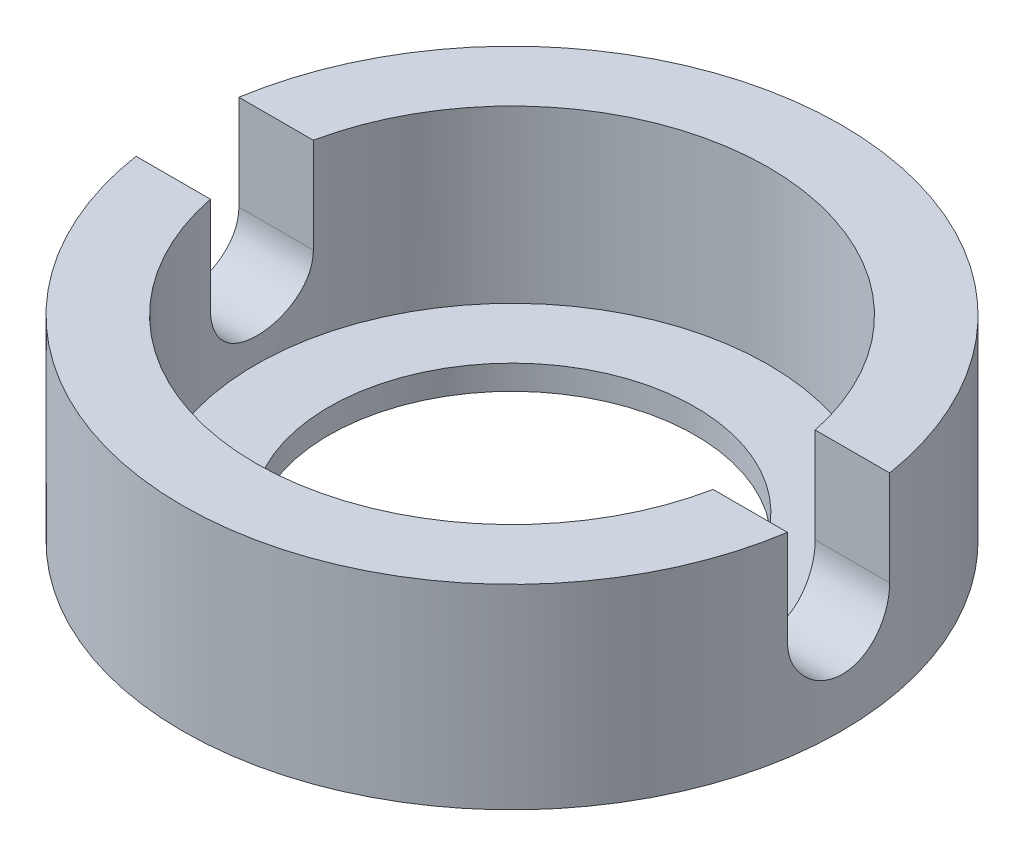
ISO-10303-21;
HEADER;
FILE_DESCRIPTION(('STEP AP214'),'2;1');
FILE_NAME('part.step','',(''),(''),'','','');
FILE_SCHEMA(('AUTOMOTIVE_DESIGN { 1 0 10303 214 1 1 1 1 }'));
ENDSEC;
DATA;
#1=APPLICATION_CONTEXT('core data for automotive mechanical design processes');
#2=APPLICATION_PROTOCOL_DEFINITION('international standard','automotive_design',2000,#1);
#3=PRODUCT_CONTEXT('',#1,'mechanical');
#4=PRODUCT('Part','Part','',(#3));
#5=PRODUCT_RELATED_PRODUCT_CATEGORY('part','',(#4));
#6=PRODUCT_DEFINITION_FORMATION('','',#4);
#7=PRODUCT_DEFINITION_CONTEXT('part definition',#1,'design');
#8=PRODUCT_DEFINITION('design','',#6,#7);
#9=PRODUCT_DEFINITION_SHAPE('','',#8);
#10=(LENGTH_UNIT() NAMED_UNIT(*) SI_UNIT(.MILLI.,.METRE.));
#11=(NAMED_UNIT(*) PLANE_ANGLE_UNIT() SI_UNIT($,.RADIAN.));
#12=(NAMED_UNIT(*) SI_UNIT($,.STERADIAN.) SOLID_ANGLE_UNIT());
#13=UNCERTAINTY_MEASURE_WITH_UNIT(LENGTH_MEASURE(1.E-05),#10,'distance_accuracy_value','');
#14=(GEOMETRIC_REPRESENTATION_CONTEXT(3) GLOBAL_UNCERTAINTY_ASSIGNED_CONTEXT((#13)) GLOBAL_UNIT_ASSIGNED_CONTEXT((#10,
#11,#12)) REPRESENTATION_CONTEXT('',''));
#15=CARTESIAN_POINT('',(0.,0.,0.));
#16=DIRECTION('',(0.,0.,1.));
#17=DIRECTION('',(1.,0.,0.));
#18=AXIS2_PLACEMENT_3D('',#15,#16,#17);
#19=CARTESIAN_POINT('',(0.,8.,0.));
#20=DIRECTION('',(0.,1.,0.));
#21=DIRECTION('',(0.,0.,1.));
#22=AXIS2_PLACEMENT_3D('',#19,#20,#21);
#23=PLANE('',#22);
#24=DIRECTION('',(1.,0.,0.));
#25=VECTOR('',#24,1.);
#26=CARTESIAN_POINT('',(-13.5,8.,-2.14085402285714));
#27=LINE('',#26,#25);
#28=CARTESIAN_POINT('',(10.2794330608656,8.,-2.14085402285714));
#29=VERTEX_POINT('',#28);
#30=CARTESIAN_POINT('',(13.3291689183091,8.,-2.14085402285714));
#31=VERTEX_POINT('',#30);
#32=EDGE_CURVE('E209',#29,#31,#27,.T.);
#33=ORIENTED_EDGE('',*,*,#32,.T.);
#34=CARTESIAN_POINT('',(0.,8.,0.));
#35=DIRECTION('',(0.,1.,0.));
#36=DIRECTION('',(0.,0.,1.));
#37=AXIS2_PLACEMENT_3D('',#34,#35,#36);
#38=CIRCLE('',#37,13.5);
#39=CARTESIAN_POINT('',(-13.3291689183091,8.,-2.14085402285714));
#40=VERTEX_POINT('',#39);
#41=EDGE_CURVE('E125',#31,#40,#38,.T.);
#42=ORIENTED_EDGE('',*,*,#41,.T.);
#43=CARTESIAN_POINT('',(-10.2794330608656,8.,-2.14085402285714));
#44=VERTEX_POINT('',#43);
#45=EDGE_CURVE('E208',#40,#44,#27,.T.);
#46=ORIENTED_EDGE('',*,*,#45,.T.);
#47=CARTESIAN_POINT('',(0.,8.,0.));
#48=DIRECTION('',(0.,1.,0.));
#49=DIRECTION('',(0.,0.,1.));
#50=AXIS2_PLACEMENT_3D('',#47,#48,#49);
#51=CIRCLE('',#50,10.5);
#52=EDGE_CURVE('E189',#29,#44,#51,.T.);
#53=ORIENTED_EDGE('',*,*,#52,.F.);
#54=EDGE_LOOP('',(#33,#42,#46,#53));
#55=FACE_BOUND('',#54,.T.);
#56=ADVANCED_FACE('F37',(#55),#23,.T.);
#57=CARTESIAN_POINT('',(0.,8.,0.));
#58=DIRECTION('',(0.,-1.,0.));
#59=DIRECTION('',(0.,0.,-1.));
#60=AXIS2_PLACEMENT_3D('',#57,#58,#59);
#61=CYLINDRICAL_SURFACE('',#60,13.5);
#62=ORIENTED_EDGE('',*,*,#41,.F.);
#63=DIRECTION('',(0.,-1.,0.));
#64=VECTOR('',#63,1.);
#65=CARTESIAN_POINT('',(13.3291689183091,8.,-2.14085402285714));
#66=LINE('',#65,#64);
#67=CARTESIAN_POINT('',(13.3291689183091,4.1,-2.14085402285715));
#68=VERTEX_POINT('',#67);
#69=EDGE_CURVE('E180',#31,#68,#66,.T.);
#70=ORIENTED_EDGE('',*,*,#69,.T.);
#71=CARTESIAN_POINT('',(13.3291689183091,4.1,-2.14085402285715));
#72=CARTESIAN_POINT('',(13.3291666447354,4.0413161164784,-2.14085407238651));
#73=CARTESIAN_POINT('',(13.3295644995685,3.9826607121262,-2.13839264517743));
#74=CARTESIAN_POINT('',(13.3311365296593,3.86577692806892,-2.1285759084212));
#75=CARTESIAN_POINT('',(13.332310631424,3.80754850846563,-2.12122106217015));
#76=CARTESIAN_POINT('',(13.3369549969305,3.63428557553989,-2.09190050732567));
#77=CARTESIAN_POINT('',(13.3415475192242,3.52042321402695,-2.06267849687624));
#78=CARTESIAN_POINT('',(13.3532128808782,3.29930130999009,-1.98574924381743));
#79=CARTESIAN_POINT('',(13.3602863268776,3.19204338994122,-1.93803747976744));
#80=CARTESIAN_POINT('',(13.3761252744474,2.98703847270402,-1.82551067120954));
#81=CARTESIAN_POINT('',(13.3848907622839,2.88929139832758,-1.76069576552313));
#82=CARTESIAN_POINT('',(13.4032284632168,2.70524685304988,-1.615199440081));
#83=CARTESIAN_POINT('',(13.4128064766904,2.61904543509215,-1.53439729057134));
#84=CARTESIAN_POINT('',(13.4316626029378,2.46135513656441,-1.35947206176285));
#85=CARTESIAN_POINT('',(13.4409406691318,2.38986853194998,-1.26534692557762));
#86=CARTESIAN_POINT('',(13.4582364186023,2.26327183313013,-1.06580560878101));
#87=CARTESIAN_POINT('',(13.4662467837811,2.20825529878887,-0.96032938282561));
#88=CARTESIAN_POINT('',(13.480066477733,2.11675958613247,-0.741493645572168));
#89=CARTESIAN_POINT('',(13.485876055882,2.0802783073871,-0.628135029168872));
#90=CARTESIAN_POINT('',(13.4946290438827,2.02717066550553,-0.397703901817571));
#91=CARTESIAN_POINT('',(13.4975949415391,2.01038828239126,-0.280668218071861));
#92=CARTESIAN_POINT('',(13.5004360537543,1.99667487448008,-0.0454029054317797));
#93=CARTESIAN_POINT('',(13.500311384789,1.99974310155889,0.0728266782995496));
#94=CARTESIAN_POINT('',(13.4970309110249,2.02552118359933,0.306000386871487));
#95=CARTESIAN_POINT('',(13.4939023183522,2.04805452312936,0.420964474333575));
#96=CARTESIAN_POINT('',(13.48502891989,2.11185042673706,0.645463790448504));
#97=CARTESIAN_POINT('',(13.4792840651514,2.15311334123666,0.754998917485399));
#98=CARTESIAN_POINT('',(13.4658115723716,2.25334990507271,0.965995365692651));
#99=CARTESIAN_POINT('',(13.4580767841202,2.31238755546053,1.06742580579377));
#100=CARTESIAN_POINT('',(13.4415093406198,2.44644918837918,1.25900199808933));
#101=CARTESIAN_POINT('',(13.4326766515168,2.52147366391659,1.34914740213626));
#102=CARTESIAN_POINT('',(13.4148115405068,2.68629929073418,1.51657743273771));
#103=CARTESIAN_POINT('',(13.4057779980137,2.77624498205364,1.59371969637863));
#104=CARTESIAN_POINT('',(13.3886336997346,2.96790478500224,1.73186322721121));
#105=CARTESIAN_POINT('',(13.3805232112246,3.0696222881237,1.79285982606983));
#106=CARTESIAN_POINT('',(13.3661547009505,3.28213822031623,1.89702102709096));
#107=CARTESIAN_POINT('',(13.3598999270953,3.39295214252401,1.94015441631568));
#108=CARTESIAN_POINT('',(13.3500085664048,3.62029112988423,2.00709629877518));
#109=CARTESIAN_POINT('',(13.3463680747604,3.73680739851517,2.03093362028725));
#110=CARTESIAN_POINT('',(13.3435070459469,3.89516364928014,2.04959287589203));
#111=CARTESIAN_POINT('',(13.3429526227291,3.93608231244235,2.05319737271173));
#112=CARTESIAN_POINT('',(13.3422131392824,4.01799474061692,2.05799810733157));
#113=CARTESIAN_POINT('',(13.3420274571562,4.05898826227041,2.05919839995311));
#114=CARTESIAN_POINT('',(13.3420273048669,4.1,2.05920066923727));
#115=B_SPLINE_CURVE_WITH_KNOTS('',3,(#71,#72,#73,#74,#75,#76,#77,#78,#79,#80,#81,#82,#83,#84,
#85,#86,#87,#88,#89,#90,#91,#92,#93,#94,#95,#96,#97,#98,#99,#100,#101,#102,#103,#104,#105,#106,
#107,#108,#109,#110,#111,#112,#113,#114),.UNSPECIFIED.,.F.,.F.,(4,2,2,2,2,2,2,2,2,2,2,2,2,2,2,2,
2,2,2,2,2,4),(0.,0.175942344481789,0.351868033572896,0.702978537167625,1.05417495472842,
1.40536852181231,1.75932301890869,2.11333222144867,2.46931582860245,2.82525908640222,
3.17836374735741,3.53145510067965,3.88137773385083,4.23130691418744,4.5825114586147,
4.93372683516233,5.28856768453747,5.64351102026306,5.99907196900305,6.35410072505367,
6.47728952574954,6.60027038628873),.UNSPECIFIED.);
#116=CARTESIAN_POINT('',(13.3420273048669,4.1,2.05920066923727));
#117=VERTEX_POINT('',#116);
#118=EDGE_CURVE('E171',#68,#117,#115,.T.);
#119=ORIENTED_EDGE('',*,*,#118,.T.);
#120=DIRECTION('',(0.,-1.,0.));
#121=VECTOR('',#120,1.);
#122=CARTESIAN_POINT('',(13.3420273048669,8.,2.05920066923727));
#123=LINE('',#122,#121);
#124=CARTESIAN_POINT('',(13.3420273048669,8.,2.05920066923727));
#125=VERTEX_POINT('',#124);
#126=EDGE_CURVE('E110',#117,#125,#123,.F.);
#127=ORIENTED_EDGE('',*,*,#126,.T.);
#128=CARTESIAN_POINT('',(-13.3420273048669,8.,2.05920066923727));
#129=VERTEX_POINT('',#128);
#130=EDGE_CURVE('E117',#129,#125,#38,.T.);
#131=ORIENTED_EDGE('',*,*,#130,.F.);
#132=DIRECTION('',(0.,-1.,0.));
#133=VECTOR('',#132,1.);
#134=CARTESIAN_POINT('',(-13.3420273048669,8.,2.05920066923727));
#135=LINE('',#134,#133);
#136=CARTESIAN_POINT('',(-13.3420273048669,4.1,2.05920066923727));
#137=VERTEX_POINT('',#136);
#138=EDGE_CURVE('E103',#129,#137,#135,.T.);
#139=ORIENTED_EDGE('',*,*,#138,.T.);
#140=CARTESIAN_POINT('',(-13.3420273048669,4.1,2.05920066923727));
#141=CARTESIAN_POINT('',(-13.3420250380575,4.04128147631315,2.05920068725546));
#142=CARTESIAN_POINT('',(-13.3424078899976,3.98259142667355,2.05673638650511));
#143=CARTESIAN_POINT('',(-13.3439201253294,3.8656381488829,2.04690797742173));
#144=CARTESIAN_POINT('',(-13.345049440144,3.80737488202074,2.03954431918867));
#145=CARTESIAN_POINT('',(-13.349515459476,3.63400348049986,2.01018745713353));
#146=CARTESIAN_POINT('',(-13.3539304317712,3.52006750257915,1.98092808729556));
#147=CARTESIAN_POINT('',(-13.3651292914457,3.29879997094988,1.9038946238669));
#148=CARTESIAN_POINT('',(-13.3719137903796,3.19147013064912,1.85611575019914));
#149=CARTESIAN_POINT('',(-13.3870718904365,2.986333575057,1.7434238501291));
#150=CARTESIAN_POINT('',(-13.395445460994,2.88852667664937,1.67851115328153));
#151=CARTESIAN_POINT('',(-13.4128982582088,2.70443431158994,1.5328292343099));
#152=CARTESIAN_POINT('',(-13.4219822000795,2.61823838893025,1.45194745928493));
#153=CARTESIAN_POINT('',(-13.4397681963649,2.46057679043533,1.27685550807547));
#154=CARTESIAN_POINT('',(-13.4484701928585,2.38911334270942,1.1826433194546));
#155=CARTESIAN_POINT('',(-13.4645365799438,2.26263923766982,0.983012822255255));
#156=CARTESIAN_POINT('',(-13.4718944208962,2.20770833955408,0.877543412647226));
#157=CARTESIAN_POINT('',(-13.4843629014716,2.11637702210465,0.658747958825261));
#158=CARTESIAN_POINT('',(-13.4894737998591,2.07997446891664,0.545422821040915));
#159=CARTESIAN_POINT('',(-13.4968096469125,2.02701239491299,0.315104173398595));
#160=CARTESIAN_POINT('',(-13.4990576540486,2.01029441299807,0.198147847187576));
#161=CARTESIAN_POINT('',(-13.5004610268427,1.99667884152571,-0.0369306006978941));
#162=CARTESIAN_POINT('',(-13.4996164968095,1.99978058346772,-0.15505268291832));
#163=CARTESIAN_POINT('',(-13.4949202765294,2.02559322095453,-0.388072741054773));
#164=CARTESIAN_POINT('',(-13.4910936157241,2.04814106984766,-0.5029893445685));
#165=CARTESIAN_POINT('',(-13.4808582201626,2.11194483335533,-0.727382210851564));
#166=CARTESIAN_POINT('',(-13.474449424277,2.15320119087884,-0.836858344754053));
#167=CARTESIAN_POINT('',(-13.459691873806,2.25344395379055,-1.04782541304566));
#168=CARTESIAN_POINT('',(-13.4513345573828,2.31250895668819,-1.14927837913141));
#169=CARTESIAN_POINT('',(-13.4335878855616,2.44663238324329,-1.34089134315004));
#170=CARTESIAN_POINT('',(-13.4241984958551,2.52169133865341,-1.43105096545362));
#171=CARTESIAN_POINT('',(-13.4052940977989,2.68661759587175,-1.59852462547168));
#172=CARTESIAN_POINT('',(-13.3957788110532,2.77663310199776,-1.67569273858411));
#173=CARTESIAN_POINT('',(-13.3777705554045,2.96845204012211,-1.81387089200554));
#174=CARTESIAN_POINT('',(-13.3692778805663,3.07025884642113,-1.87487629055116));
#175=CARTESIAN_POINT('',(-13.3542628952236,3.28290934600207,-1.97900077483558));
#176=CARTESIAN_POINT('',(-13.3477428877928,3.39376341171704,-2.02209897579874));
#177=CARTESIAN_POINT('',(-13.3374437940134,3.62118630177348,-2.08896070452407));
#178=CARTESIAN_POINT('',(-13.3336605868971,3.73774625108898,-2.11275330709532));
#179=CARTESIAN_POINT('',(-13.3306966479362,3.89598198987697,-2.13132301877717));
#180=CARTESIAN_POINT('',(-13.3301242141642,3.93673759011745,-2.13489869627123));
#181=CARTESIAN_POINT('',(-13.3293607571607,4.01832290490787,-2.13966105704106));
#182=CARTESIAN_POINT('',(-13.3291690935136,4.05915237921512,-2.14085175163675));
#183=CARTESIAN_POINT('',(-13.3291689183091,4.1,-2.14085402285715));
#184=B_SPLINE_CURVE_WITH_KNOTS('',3,(#140,#141,#142,#143,#144,#145,#146,#147,#148,#149,#150,
#151,#152,#153,#154,#155,#156,#157,#158,#159,#160,#161,#162,#163,#164,#165,#166,#167,#168,#169,
#170,#171,#172,#173,#174,#175,#176,#177,#178,#179,#180,#181,#182,#183),.UNSPECIFIED.,.F.,.F.,(4,
2,2,2,2,2,2,2,2,2,2,2,2,2,2,2,2,2,2,2,2,4),(0.,0.176046273083847,0.352076375172935,
0.703407342414107,1.05482905229263,1.40624400336172,1.76023039985652,2.11427029331727,
2.46999179463071,2.82567231928293,3.17846959802627,3.53125497731364,3.88111085632614,
4.23097501832883,4.58240646953303,4.93384960664002,5.28900925344732,5.64427078811474,
5.99994550140252,6.3550835584917,6.47777892470032,6.60026775482408),.UNSPECIFIED.);
#185=CARTESIAN_POINT('',(-13.3291689183091,4.1,-2.14085402285715));
#186=VERTEX_POINT('',#185);
#187=EDGE_CURVE('E109',#137,#186,#184,.T.);
#188=ORIENTED_EDGE('',*,*,#187,.T.);
#189=DIRECTION('',(0.,-1.,0.));
#190=VECTOR('',#189,1.);
#191=CARTESIAN_POINT('',(-13.3291689183091,8.,-2.14085402285714));
#192=LINE('',#191,#190);
#193=EDGE_CURVE('E177',#186,#40,#192,.F.);
#194=ORIENTED_EDGE('',*,*,#193,.T.);
#195=EDGE_LOOP('',(#62,#70,#119,#127,#131,#139,#188,#194));
#196=FACE_BOUND('',#195,.T.);
#197=CARTESIAN_POINT('',(0.,0.,0.));
#198=DIRECTION('',(0.,1.,0.));
#199=DIRECTION('',(0.,0.,1.));
#200=AXIS2_PLACEMENT_3D('',#197,#198,#199);
#201=CIRCLE('',#200,13.5);
#202=CARTESIAN_POINT('',(0.,0.,13.5));
#203=VERTEX_POINT('',#202);
#204=EDGE_CURVE('E126',#203,#203,#201,.T.);
#205=ORIENTED_EDGE('',*,*,#204,.T.);
#206=EDGE_LOOP('',(#205));
#207=FACE_BOUND('',#206,.T.);
#208=ADVANCED_FACE('F39',(#196,#207),#61,.T.);
#209=DIRECTION('',(1.,0.,0.));
#210=VECTOR('',#209,1.);
#211=CARTESIAN_POINT('',(-13.5,8.,2.05920066923727));
#212=LINE('',#211,#210);
#213=CARTESIAN_POINT('',(-10.2961008446796,8.,2.05920066923727));
#214=VERTEX_POINT('',#213);
#215=EDGE_CURVE('E61',#129,#214,#212,.T.);
#216=ORIENTED_EDGE('',*,*,#215,.F.);
#217=ORIENTED_EDGE('',*,*,#130,.T.);
#218=CARTESIAN_POINT('',(10.2961008446796,8.,2.05920066923727));
#219=VERTEX_POINT('',#218);
#220=EDGE_CURVE('E120',#219,#125,#212,.T.);
#221=ORIENTED_EDGE('',*,*,#220,.F.);
#222=EDGE_CURVE('E119',#214,#219,#51,.T.);
#223=ORIENTED_EDGE('',*,*,#222,.F.);
#224=EDGE_LOOP('',(#216,#217,#221,#223));
#225=FACE_BOUND('',#224,.T.);
#226=ADVANCED_FACE('F115',(#225),#23,.T.);
#227=CARTESIAN_POINT('',(0.,0.,0.));
#228=DIRECTION('',(0.,1.,0.));
#229=DIRECTION('',(0.,0.,1.));
#230=AXIS2_PLACEMENT_3D('',#227,#228,#229);
#231=PLANE('',#230);
#232=CARTESIAN_POINT('',(0.,0.,0.));
#233=DIRECTION('',(0.,1.,0.));
#234=DIRECTION('',(0.,0.,1.));
#235=AXIS2_PLACEMENT_3D('',#232,#233,#234);
#236=CIRCLE('',#235,7.5);
#237=CARTESIAN_POINT('',(0.,0.,7.5));
#238=VERTEX_POINT('',#237);
#239=EDGE_CURVE('E184',#238,#238,#236,.T.);
#240=ORIENTED_EDGE('',*,*,#239,.T.);
#241=EDGE_LOOP('',(#240));
#242=FACE_BOUND('',#241,.T.);
#243=ORIENTED_EDGE('',*,*,#204,.F.);
#244=EDGE_LOOP('',(#243));
#245=FACE_BOUND('',#244,.T.);
#246=ADVANCED_FACE('F223',(#242,#245),#231,.F.);
#247=CARTESIAN_POINT('',(0.,1.,0.));
#248=DIRECTION('',(0.,1.,0.));
#249=DIRECTION('',(0.,0.,1.));
#250=AXIS2_PLACEMENT_3D('',#247,#248,#249);
#251=CYLINDRICAL_SURFACE('',#250,10.5);
#252=CARTESIAN_POINT('',(0.,1.,0.));
#253=DIRECTION('',(0.,1.,0.));
#254=DIRECTION('',(0.,0.,1.));
#255=AXIS2_PLACEMENT_3D('',#252,#253,#254);
#256=CIRCLE('',#255,10.5);
#257=CARTESIAN_POINT('',(0.,1.,10.5));
#258=VERTEX_POINT('',#257);
#259=EDGE_CURVE('E131',#258,#258,#256,.T.);
#260=ORIENTED_EDGE('',*,*,#259,.F.);
#261=EDGE_LOOP('',(#260));
#262=FACE_BOUND('',#261,.T.);
#263=CARTESIAN_POINT('',(10.2961008446796,4.1,2.05920066923727));
#264=CARTESIAN_POINT('',(10.2960978502634,4.0415203313302,2.05920095545284));
#265=CARTESIAN_POINT('',(10.2965900148061,3.9830692557303,2.05675638837365));
#266=CARTESIAN_POINT('',(10.2985335354658,3.86659681248869,2.04700846317528));
#267=CARTESIAN_POINT('',(10.2999847751837,3.80857539356531,2.0397056946754));
#268=CARTESIAN_POINT('',(10.3057214983596,3.6359671917194,2.01060179831211));
#269=CARTESIAN_POINT('',(10.3113902777199,3.52255470866377,1.98160473491023));
#270=CARTESIAN_POINT('',(10.3257585528154,3.30232888093954,1.90530768261104));
#271=CARTESIAN_POINT('',(10.334458417328,3.19551634111653,1.85800546653717));
#272=CARTESIAN_POINT('',(10.3538887650087,2.99131074299452,1.74647658515652));
#273=CARTESIAN_POINT('',(10.3646194403572,2.89391857748628,1.68224831787272));
#274=CARTESIAN_POINT('',(10.3870430531995,2.71003831906547,1.53776785545604));
#275=CARTESIAN_POINT('',(10.3987460729661,2.62369661302993,1.45733096890718));
#276=CARTESIAN_POINT('',(10.4216768429921,2.46563288581598,1.28310505416451));
#277=CARTESIAN_POINT('',(10.432904520767,2.39391308800493,1.1893139990494));
#278=CARTESIAN_POINT('',(10.4536967315664,2.26659684281137,0.990109895525937));
#279=CARTESIAN_POINT('',(10.4632472159713,2.21113420556733,0.884609737120281));
#280=CARTESIAN_POINT('',(10.479458876605,2.11877850310552,0.665571390832812));
#281=CARTESIAN_POINT('',(10.4861204845865,2.081882662882,0.552034407035389));
#282=CARTESIAN_POINT('',(10.4956934752195,2.02817655497769,0.321742146447822));
#283=CARTESIAN_POINT('',(10.4986534372298,2.01110631872392,0.20504954667292));
#284=CARTESIAN_POINT('',(10.5006134439046,1.99671692914618,-0.0295774526646849));
#285=CARTESIAN_POINT('',(10.4996137646798,1.99939639866194,-0.147511765069282));
#286=CARTESIAN_POINT('',(10.4937706698322,2.02423461763458,-0.379567275487358));
#287=CARTESIAN_POINT('',(10.4889800779781,2.0461261144693,-0.493718574609014));
#288=CARTESIAN_POINT('',(10.4761081130621,2.10833534941379,-0.71668513649674));
#289=CARTESIAN_POINT('',(10.4680266196867,2.1486537612076,-0.82550020401026));
#290=CARTESIAN_POINT('',(10.4493434692553,2.2468632433064,-1.03558261674724));
#291=CARTESIAN_POINT('',(10.438724546953,2.3048754886043,-1.13679172024091));
#292=CARTESIAN_POINT('',(10.4161102203811,2.43673406496686,-1.32813562876856));
#293=CARTESIAN_POINT('',(10.4041146990433,2.51058174316742,-1.41826949059399));
#294=CARTESIAN_POINT('',(10.3797957517083,2.6735538800855,-1.58657144015987));
#295=CARTESIAN_POINT('',(10.3674702645982,2.76292355964465,-1.66450193572487));
#296=CARTESIAN_POINT('',(10.3440542074896,2.95362709507465,-1.80432409798464));
#297=CARTESIAN_POINT('',(10.3329639781993,3.05496423600496,-1.86621134585457));
#298=CARTESIAN_POINT('',(10.3132528852237,3.26702930926522,-1.9722426783931));
#299=CARTESIAN_POINT('',(10.3046375832124,3.37777767854571,-2.0163468892074));
#300=CARTESIAN_POINT('',(10.2909299510095,3.60525776577763,-2.08518914945158));
#301=CARTESIAN_POINT('',(10.2858323374422,3.7219802264656,-2.10995624955105));
#302=CARTESIAN_POINT('',(10.281673672051,3.88302983319146,-2.13007125531339));
#303=CARTESIAN_POINT('',(10.2808343415574,3.92635870473771,-2.13411617960897));
#304=CARTESIAN_POINT('',(10.2797145107756,4.01311853399728,-2.1395041741175));
#305=CARTESIAN_POINT('',(10.2794330773962,4.05654919941608,-2.14085175571214));
#306=CARTESIAN_POINT('',(10.2794330608656,4.1,-2.14085402285715));
#307=B_SPLINE_CURVE_WITH_KNOTS('',3,(#263,#264,#265,#266,#267,#268,#269,#270,#271,#272,#273,
#274,#275,#276,#277,#278,#279,#280,#281,#282,#283,#284,#285,#286,#287,#288,#289,#290,#291,#292,
#293,#294,#295,#296,#297,#298,#299,#300,#301,#302,#303,#304,#305,#306),.UNSPECIFIED.,.F.,.F.,(4,
2,2,2,2,2,2,2,2,2,2,2,2,2,2,2,2,2,2,2,2,4),(0.,0.175329402459234,0.350637529813798,
0.700419446039913,1.0502439334018,1.40010154202611,1.75419739797084,2.10834705667076,
2.46533469567421,2.82226896321059,3.17446801845092,3.52664251484649,3.87399431759665,
4.22135882046989,4.57115777474089,4.92098649856809,5.27695081747857,5.63301307645519,
5.98986933137228,6.3461884342468,6.47669735456707,6.60698781203551),.UNSPECIFIED.);
#308=CARTESIAN_POINT('',(10.2961008446796,4.1,2.05920066923727));
#309=VERTEX_POINT('',#308);
#310=CARTESIAN_POINT('',(10.2794330608656,4.1,-2.14085402285715));
#311=VERTEX_POINT('',#310);
#312=EDGE_CURVE('E46',#309,#311,#307,.T.);
#313=ORIENTED_EDGE('',*,*,#312,.T.);
#314=DIRECTION('',(0.,1.,0.));
#315=VECTOR('',#314,1.);
#316=CARTESIAN_POINT('',(10.2794330608656,1.,-2.14085402285715));
#317=LINE('',#316,#315);
#318=EDGE_CURVE('E11',#311,#29,#317,.T.);
#319=ORIENTED_EDGE('',*,*,#318,.T.);
#320=ORIENTED_EDGE('',*,*,#52,.T.);
#321=DIRECTION('',(0.,1.,0.));
#322=VECTOR('',#321,1.);
#323=CARTESIAN_POINT('',(-10.2794330608656,1.,-2.14085402285715));
#324=LINE('',#323,#322);
#325=CARTESIAN_POINT('',(-10.2794330608656,4.1,-2.14085402285715));
#326=VERTEX_POINT('',#325);
#327=EDGE_CURVE('E145',#44,#326,#324,.F.);
#328=ORIENTED_EDGE('',*,*,#327,.T.);
#329=CARTESIAN_POINT('',(-10.2794330608656,4.1,-2.14085402285715));
#330=CARTESIAN_POINT('',(-10.2794300497189,4.04157786349726,-2.1408543610372));
#331=CARTESIAN_POINT('',(-10.2799414385396,3.9831843298389,-2.13841454636568));
#332=CARTESIAN_POINT('',(-10.2819615273794,3.86682732020739,-2.12868592444515));
#333=CARTESIAN_POINT('',(-10.2834701016369,3.80886379093564,-2.12139772865601));
#334=CARTESIAN_POINT('',(-10.2894348779916,3.63643567495575,-2.09235384370334));
#335=CARTESIAN_POINT('',(-10.2953304365719,3.52314540753755,-2.06341849939474));
#336=CARTESIAN_POINT('',(-10.3102933641365,3.30316146396367,-1.98729350958736));
#337=CARTESIAN_POINT('',(-10.3193610468425,3.19646844150148,-1.94010205851808));
#338=CARTESIAN_POINT('',(-10.3396571763303,2.99248195285056,-1.82884554686307));
#339=CARTESIAN_POINT('',(-10.350885866707,2.89518954818478,-1.76477858372173));
#340=CARTESIAN_POINT('',(-10.3744410202303,2.71139098899678,-1.62060557826904));
#341=CARTESIAN_POINT('',(-10.3867798703498,2.62504172255031,-1.54030161306431));
#342=CARTESIAN_POINT('',(-10.4110890114725,2.46693340285641,-1.36635453626766));
#343=CARTESIAN_POINT('',(-10.4230592440497,2.3951766525351,-1.27270932317866));
#344=CARTESIAN_POINT('',(-10.4454474154041,2.26765779544746,-1.07365603312942));
#345=CARTESIAN_POINT('',(-10.4558496962335,2.21205246361814,-0.968145610802471));
#346=CARTESIAN_POINT('',(-10.4738245936481,2.11942245398688,-0.749042244011542));
#347=CARTESIAN_POINT('',(-10.4813976241342,2.08239505808229,-0.635450484691046));
#348=CARTESIAN_POINT('',(-10.492813289697,2.0284456692933,-0.40497201563142));
#349=CARTESIAN_POINT('',(-10.4967032836667,2.01126778586857,-0.288147591385897));
#350=CARTESIAN_POINT('',(-10.5005221274011,1.99671443016903,-0.0532100477935262));
#351=CARTESIAN_POINT('',(-10.5004512805206,1.99933744135991,0.0649029721689525));
#352=CARTESIAN_POINT('',(-10.49642643658,2.02411732946966,0.297214242084916));
#353=CARTESIAN_POINT('',(-10.492529918631,2.04598456611605,0.411444558400804));
#354=CARTESIAN_POINT('',(-10.4814018855771,2.10818013129637,0.63458826818168));
#355=CARTESIAN_POINT('',(-10.4741702743367,2.14850899199459,0.743501508279493));
#356=CARTESIAN_POINT('',(-10.4571394209589,2.24670931073482,0.953635764834757));
#357=CARTESIAN_POINT('',(-10.4473259464882,2.30467829510413,1.05481000108632));
#358=CARTESIAN_POINT('',(-10.4262416501084,2.4364399920587,1.24609760224937));
#359=CARTESIAN_POINT('',(-10.4149707106779,2.51023398099526,1.336210074062));
#360=CARTESIAN_POINT('',(-10.3920163436133,2.67304484648645,1.50443989415841));
#361=CARTESIAN_POINT('',(-10.3803291586359,2.7623002371639,1.58232603617969));
#362=CARTESIAN_POINT('',(-10.3580616294068,2.95274267051778,1.72208730546259));
#363=CARTESIAN_POINT('',(-10.3474815938486,3.05393302424057,1.78395797436574));
#364=CARTESIAN_POINT('',(-10.3286328274957,3.26577163002442,1.89004427644451));
#365=CARTESIAN_POINT('',(-10.3203714721901,3.37644863293332,1.93420375899864));
#366=CARTESIAN_POINT('',(-10.3072084529946,3.60377858539652,2.00317434894508));
#367=CARTESIAN_POINT('',(-10.3023018198213,3.72042241970293,2.02801408184198));
#368=CARTESIAN_POINT('',(-10.2982794824195,3.8816660906779,2.04828157481459));
#369=CARTESIAN_POINT('',(-10.2974634184277,3.9252665111428,2.05237765981974));
#370=CARTESIAN_POINT('',(-10.2963745415926,4.0125714048967,2.05783378411792));
#371=CARTESIAN_POINT('',(-10.2961008175716,4.0562755799394,2.05919841253161));
#372=CARTESIAN_POINT('',(-10.2961008446796,4.1,2.05920066923727));
#373=B_SPLINE_CURVE_WITH_KNOTS('',3,(#329,#330,#331,#332,#333,#334,#335,#336,#337,#338,#339,
#340,#341,#342,#343,#344,#345,#346,#347,#348,#349,#350,#351,#352,#353,#354,#355,#356,#357,#358,
#359,#360,#361,#362,#363,#364,#365,#366,#367,#368,#369,#370,#371,#372),.UNSPECIFIED.,.F.,.F.,(4,
2,2,2,2,2,2,2,2,2,2,2,2,2,2,2,2,2,2,2,2,4),(0.,0.175156788890952,0.350291491842902,
0.699707626857063,1.0491583287606,1.39864844482627,1.75268782151301,2.10678302783719,
2.46420846162404,2.82158158591179,3.17429433532048,3.52698007102228,3.87444669597824,
4.22192333744052,4.57135708177363,4.92081901997286,5.27625072708452,5.63178127248278,
5.98843022881539,6.34454973684585,6.47588132597065,6.60699207903848),.UNSPECIFIED.);
#374=CARTESIAN_POINT('',(-10.2961008446796,4.1,2.05920066923727));
#375=VERTEX_POINT('',#374);
#376=EDGE_CURVE('E137',#326,#375,#373,.T.);
#377=ORIENTED_EDGE('',*,*,#376,.T.);
#378=DIRECTION('',(0.,1.,0.));
#379=VECTOR('',#378,1.);
#380=CARTESIAN_POINT('',(-10.2961008446796,0.999999999999999,2.05920066923727));
#381=LINE('',#380,#379);
#382=EDGE_CURVE('E129',#375,#214,#381,.T.);
#383=ORIENTED_EDGE('',*,*,#382,.T.);
#384=ORIENTED_EDGE('',*,*,#222,.T.);
#385=DIRECTION('',(0.,1.,0.));
#386=VECTOR('',#385,1.);
#387=CARTESIAN_POINT('',(10.2961008446796,0.999999999999999,2.05920066923727));
#388=LINE('',#387,#386);
#389=EDGE_CURVE('E198',#219,#309,#388,.F.);
#390=ORIENTED_EDGE('',*,*,#389,.T.);
#391=EDGE_LOOP('',(#313,#319,#320,#328,#377,#383,#384,#390));
#392=FACE_BOUND('',#391,.T.);
#393=ADVANCED_FACE('F147',(#262,#392),#251,.F.);
#394=CARTESIAN_POINT('',(0.,1.,0.));
#395=DIRECTION('',(0.,1.,0.));
#396=DIRECTION('',(0.,0.,1.));
#397=AXIS2_PLACEMENT_3D('',#394,#395,#396);
#398=PLANE('',#397);
#399=CARTESIAN_POINT('',(0.,1.,0.));
#400=DIRECTION('',(0.,1.,0.));
#401=DIRECTION('',(0.,0.,1.));
#402=AXIS2_PLACEMENT_3D('',#399,#400,#401);
#403=CIRCLE('',#402,7.5);
#404=CARTESIAN_POINT('',(0.,1.,7.5));
#405=VERTEX_POINT('',#404);
#406=EDGE_CURVE('E183',#405,#405,#403,.T.);
#407=ORIENTED_EDGE('',*,*,#406,.F.);
#408=EDGE_LOOP('',(#407));
#409=FACE_BOUND('',#408,.T.);
#410=ORIENTED_EDGE('',*,*,#259,.T.);
#411=EDGE_LOOP('',(#410));
#412=FACE_BOUND('',#411,.T.);
#413=ADVANCED_FACE('F231',(#409,#412),#398,.T.);
#414=CARTESIAN_POINT('',(0.,0.,0.));
#415=DIRECTION('',(0.,1.,0.));
#416=DIRECTION('',(0.,0.,1.));
#417=AXIS2_PLACEMENT_3D('',#414,#415,#416);
#418=CYLINDRICAL_SURFACE('',#417,7.5);
#419=ORIENTED_EDGE('',*,*,#239,.F.);
#420=EDGE_LOOP('',(#419));
#421=FACE_BOUND('',#420,.T.);
#422=ORIENTED_EDGE('',*,*,#406,.T.);
#423=EDGE_LOOP('',(#422));
#424=FACE_BOUND('',#423,.T.);
#425=ADVANCED_FACE('F237',(#421,#424),#418,.F.);
#426=CARTESIAN_POINT('',(-13.5,8.,2.05920066923727));
#427=DIRECTION('',(0.,0.,1.));
#428=DIRECTION('',(0.,-1.,0.));
#429=AXIS2_PLACEMENT_3D('',#426,#427,#428);
#430=PLANE('',#429);
#431=ORIENTED_EDGE('',*,*,#215,.T.);
#432=ORIENTED_EDGE('',*,*,#382,.F.);
#433=DIRECTION('',(1.,0.,0.));
#434=VECTOR('',#433,1.);
#435=CARTESIAN_POINT('',(-13.5,4.1,2.05920066923727));
#436=LINE('',#435,#434);
#437=EDGE_CURVE('E106',#137,#375,#436,.T.);
#438=ORIENTED_EDGE('',*,*,#437,.F.);
#439=ORIENTED_EDGE('',*,*,#138,.F.);
#440=EDGE_LOOP('',(#431,#432,#438,#439));
#441=FACE_BOUND('',#440,.T.);
#442=ADVANCED_FACE('F104',(#441),#430,.F.);
#443=CARTESIAN_POINT('',(-13.5,4.1,-0.0408266768099396));
#444=DIRECTION('',(1.,0.,0.));
#445=DIRECTION('',(0.,0.,-1.));
#446=AXIS2_PLACEMENT_3D('',#443,#444,#445);
#447=CYLINDRICAL_SURFACE('',#446,2.10002734604721);
#448=ORIENTED_EDGE('',*,*,#437,.T.);
#449=ORIENTED_EDGE('',*,*,#376,.F.);
#450=DIRECTION('',(1.,0.,0.));
#451=VECTOR('',#450,1.);
#452=CARTESIAN_POINT('',(-13.5,4.1,-2.14085402285715));
#453=LINE('',#452,#451);
#454=EDGE_CURVE('E205',#186,#326,#453,.T.);
#455=ORIENTED_EDGE('',*,*,#454,.F.);
#456=ORIENTED_EDGE('',*,*,#187,.F.);
#457=EDGE_LOOP('',(#448,#449,#455,#456));
#458=FACE_BOUND('',#457,.T.);
#459=ADVANCED_FACE('F158',(#458),#447,.F.);
#460=CARTESIAN_POINT('',(-13.5,8.,-2.14085402285714));
#461=DIRECTION('',(0.,0.,-1.));
#462=DIRECTION('',(0.,1.,0.));
#463=AXIS2_PLACEMENT_3D('',#460,#461,#462);
#464=PLANE('',#463);
#465=ORIENTED_EDGE('',*,*,#454,.T.);
#466=ORIENTED_EDGE('',*,*,#327,.F.);
#467=ORIENTED_EDGE('',*,*,#45,.F.);
#468=ORIENTED_EDGE('',*,*,#193,.F.);
#469=EDGE_LOOP('',(#465,#466,#467,#468));
#470=FACE_BOUND('',#469,.T.);
#471=ADVANCED_FACE('F213',(#470),#464,.F.);
#472=ORIENTED_EDGE('',*,*,#32,.F.);
#473=ORIENTED_EDGE('',*,*,#318,.F.);
#474=EDGE_CURVE('E202',#311,#68,#453,.T.);
#475=ORIENTED_EDGE('',*,*,#474,.T.);
#476=ORIENTED_EDGE('',*,*,#69,.F.);
#477=EDGE_LOOP('',(#472,#473,#475,#476));
#478=FACE_BOUND('',#477,.T.);
#479=ADVANCED_FACE('F156',(#478),#464,.F.);
#480=ORIENTED_EDGE('',*,*,#474,.F.);
#481=ORIENTED_EDGE('',*,*,#312,.F.);
#482=EDGE_CURVE('E53',#309,#117,#436,.T.);
#483=ORIENTED_EDGE('',*,*,#482,.T.);
#484=ORIENTED_EDGE('',*,*,#118,.F.);
#485=EDGE_LOOP('',(#480,#481,#483,#484));
#486=FACE_BOUND('',#485,.T.);
#487=ADVANCED_FACE('F151',(#486),#447,.F.);
#488=ORIENTED_EDGE('',*,*,#482,.F.);
#489=ORIENTED_EDGE('',*,*,#389,.F.);
#490=ORIENTED_EDGE('',*,*,#220,.T.);
#491=ORIENTED_EDGE('',*,*,#126,.F.);
#492=EDGE_LOOP('',(#488,#489,#490,#491));
#493=FACE_BOUND('',#492,.T.);
#494=ADVANCED_FACE('F155',(#493),#430,.F.);
#495=CLOSED_SHELL('',(#56,#208,#226,#246,#393,#413,#425,#442,#459,#471,#479,#487,#494));
#496=MANIFOLD_SOLID_BREP('B2',#495);
#497=ADVANCED_BREP_SHAPE_REPRESENTATION('',(#18,#496),#14);
#498=SHAPE_DEFINITION_REPRESENTATION(#9,#497);
ENDSEC;
END-ISO-10303-21;
